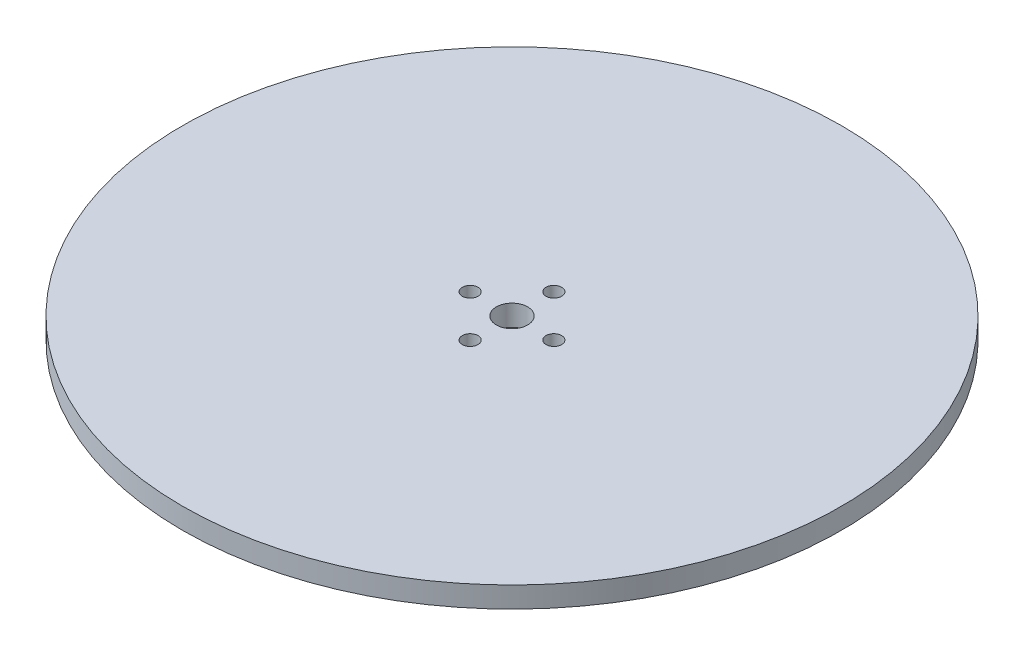
ISO-10303-21;
HEADER;
FILE_DESCRIPTION(('STEP AP214'),'2;1');
FILE_NAME('part.step','',(''),(''),'','','');
FILE_SCHEMA(('AUTOMOTIVE_DESIGN { 1 0 10303 214 1 1 1 1 }'));
ENDSEC;
DATA;
#1=APPLICATION_CONTEXT('core data for automotive mechanical design processes');
#2=APPLICATION_PROTOCOL_DEFINITION('international standard','automotive_design',2000,#1);
#3=PRODUCT_CONTEXT('',#1,'mechanical');
#4=PRODUCT('Part','Part','',(#3));
#5=PRODUCT_RELATED_PRODUCT_CATEGORY('part','',(#4));
#6=PRODUCT_DEFINITION_FORMATION('','',#4);
#7=PRODUCT_DEFINITION_CONTEXT('part definition',#1,'design');
#8=PRODUCT_DEFINITION('design','',#6,#7);
#9=PRODUCT_DEFINITION_SHAPE('','',#8);
#10=(LENGTH_UNIT() NAMED_UNIT(*) SI_UNIT(.MILLI.,.METRE.));
#11=(NAMED_UNIT(*) PLANE_ANGLE_UNIT() SI_UNIT($,.RADIAN.));
#12=(NAMED_UNIT(*) SI_UNIT($,.STERADIAN.) SOLID_ANGLE_UNIT());
#13=UNCERTAINTY_MEASURE_WITH_UNIT(LENGTH_MEASURE(1.E-05),#10,'distance_accuracy_value','');
#14=(GEOMETRIC_REPRESENTATION_CONTEXT(3) GLOBAL_UNCERTAINTY_ASSIGNED_CONTEXT((#13)) GLOBAL_UNIT_ASSIGNED_CONTEXT((#10,
#11,#12)) REPRESENTATION_CONTEXT('',''));
#15=CARTESIAN_POINT('',(0.,0.,0.));
#16=DIRECTION('',(0.,0.,1.));
#17=DIRECTION('',(1.,0.,0.));
#18=AXIS2_PLACEMENT_3D('',#15,#16,#17);
#19=CARTESIAN_POINT('',(0.,4.,0.));
#20=DIRECTION('',(0.,-1.,0.));
#21=DIRECTION('',(0.,0.,-1.));
#22=AXIS2_PLACEMENT_3D('',#19,#20,#21);
#23=CYLINDRICAL_SURFACE('',#22,63.);
#24=CARTESIAN_POINT('',(0.,4.,0.));
#25=DIRECTION('',(0.,1.,0.));
#26=DIRECTION('',(0.,0.,1.));
#27=AXIS2_PLACEMENT_3D('',#24,#25,#26);
#28=CIRCLE('',#27,63.);
#29=CARTESIAN_POINT('',(0.,4.,63.));
#30=VERTEX_POINT('',#29);
#31=EDGE_CURVE('E10',#30,#30,#28,.T.);
#32=ORIENTED_EDGE('',*,*,#31,.F.);
#33=EDGE_LOOP('',(#32));
#34=FACE_BOUND('',#33,.T.);
#35=CARTESIAN_POINT('',(0.,0.,0.));
#36=DIRECTION('',(0.,1.,0.));
#37=DIRECTION('',(0.,0.,1.));
#38=AXIS2_PLACEMENT_3D('',#35,#36,#37);
#39=CIRCLE('',#38,63.);
#40=CARTESIAN_POINT('',(0.,0.,63.));
#41=VERTEX_POINT('',#40);
#42=EDGE_CURVE('E42',#41,#41,#39,.T.);
#43=ORIENTED_EDGE('',*,*,#42,.T.);
#44=EDGE_LOOP('',(#43));
#45=FACE_BOUND('',#44,.T.);
#46=ADVANCED_FACE('F39',(#34,#45),#23,.T.);
#47=CARTESIAN_POINT('',(0.,4.,0.));
#48=DIRECTION('',(0.,1.,0.));
#49=DIRECTION('',(0.,0.,1.));
#50=AXIS2_PLACEMENT_3D('',#47,#48,#49);
#51=PLANE('',#50);
#52=CARTESIAN_POINT('',(8.,4.,0.));
#53=DIRECTION('',(0.,1.,0.));
#54=DIRECTION('',(0.,0.,1.));
#55=AXIS2_PLACEMENT_3D('',#52,#53,#54);
#56=CIRCLE('',#55,1.5);
#57=CARTESIAN_POINT('',(8.,4.,1.5));
#58=VERTEX_POINT('',#57);
#59=EDGE_CURVE('E70',#58,#58,#56,.T.);
#60=ORIENTED_EDGE('',*,*,#59,.F.);
#61=EDGE_LOOP('',(#60));
#62=FACE_BOUND('',#61,.T.);
#63=CARTESIAN_POINT('',(0.,4.,0.));
#64=DIRECTION('',(0.,1.,0.));
#65=DIRECTION('',(0.,0.,1.));
#66=AXIS2_PLACEMENT_3D('',#63,#64,#65);
#67=CIRCLE('',#66,3.);
#68=CARTESIAN_POINT('',(0.,4.,3.));
#69=VERTEX_POINT('',#68);
#70=EDGE_CURVE('E71',#69,#69,#67,.T.);
#71=ORIENTED_EDGE('',*,*,#70,.F.);
#72=EDGE_LOOP('',(#71));
#73=FACE_BOUND('',#72,.T.);
#74=CARTESIAN_POINT('',(0.,4.,8.));
#75=DIRECTION('',(0.,1.,0.));
#76=DIRECTION('',(0.,0.,1.));
#77=AXIS2_PLACEMENT_3D('',#74,#75,#76);
#78=CIRCLE('',#77,1.5);
#79=CARTESIAN_POINT('',(0.,4.,9.5));
#80=VERTEX_POINT('',#79);
#81=EDGE_CURVE('E79',#80,#80,#78,.T.);
#82=ORIENTED_EDGE('',*,*,#81,.F.);
#83=EDGE_LOOP('',(#82));
#84=FACE_BOUND('',#83,.T.);
#85=CARTESIAN_POINT('',(-8.,4.,0.));
#86=DIRECTION('',(0.,1.,0.));
#87=DIRECTION('',(0.,0.,1.));
#88=AXIS2_PLACEMENT_3D('',#85,#86,#87);
#89=CIRCLE('',#88,1.5);
#90=CARTESIAN_POINT('',(-8.,4.,1.5));
#91=VERTEX_POINT('',#90);
#92=EDGE_CURVE('E53',#91,#91,#89,.T.);
#93=ORIENTED_EDGE('',*,*,#92,.F.);
#94=EDGE_LOOP('',(#93));
#95=FACE_BOUND('',#94,.T.);
#96=CARTESIAN_POINT('',(0.,4.,-8.));
#97=DIRECTION('',(0.,1.,0.));
#98=DIRECTION('',(0.,0.,1.));
#99=AXIS2_PLACEMENT_3D('',#96,#97,#98);
#100=CIRCLE('',#99,1.5);
#101=CARTESIAN_POINT('',(0.,4.,-6.5));
#102=VERTEX_POINT('',#101);
#103=EDGE_CURVE('E62',#102,#102,#100,.T.);
#104=ORIENTED_EDGE('',*,*,#103,.F.);
#105=EDGE_LOOP('',(#104));
#106=FACE_BOUND('',#105,.T.);
#107=ORIENTED_EDGE('',*,*,#31,.T.);
#108=EDGE_LOOP('',(#107));
#109=FACE_BOUND('',#108,.T.);
#110=ADVANCED_FACE('F103',(#62,#73,#84,#95,#106,#109),#51,.T.);
#111=CARTESIAN_POINT('',(0.,0.,0.));
#112=DIRECTION('',(0.,1.,0.));
#113=DIRECTION('',(0.,0.,1.));
#114=AXIS2_PLACEMENT_3D('',#111,#112,#113);
#115=PLANE('',#114);
#116=CARTESIAN_POINT('',(8.,0.,0.));
#117=DIRECTION('',(0.,1.,0.));
#118=DIRECTION('',(0.,0.,1.));
#119=AXIS2_PLACEMENT_3D('',#116,#117,#118);
#120=CIRCLE('',#119,1.5);
#121=CARTESIAN_POINT('',(8.,0.,1.5));
#122=VERTEX_POINT('',#121);
#123=EDGE_CURVE('E51',#122,#122,#120,.T.);
#124=ORIENTED_EDGE('',*,*,#123,.T.);
#125=EDGE_LOOP('',(#124));
#126=FACE_BOUND('',#125,.T.);
#127=CARTESIAN_POINT('',(0.,0.,0.));
#128=DIRECTION('',(0.,1.,0.));
#129=DIRECTION('',(0.,0.,1.));
#130=AXIS2_PLACEMENT_3D('',#127,#128,#129);
#131=CIRCLE('',#130,3.);
#132=CARTESIAN_POINT('',(0.,0.,3.));
#133=VERTEX_POINT('',#132);
#134=EDGE_CURVE('E75',#133,#133,#131,.T.);
#135=ORIENTED_EDGE('',*,*,#134,.T.);
#136=EDGE_LOOP('',(#135));
#137=FACE_BOUND('',#136,.T.);
#138=CARTESIAN_POINT('',(0.,0.,8.));
#139=DIRECTION('',(0.,1.,0.));
#140=DIRECTION('',(0.,0.,1.));
#141=AXIS2_PLACEMENT_3D('',#138,#139,#140);
#142=CIRCLE('',#141,1.5);
#143=CARTESIAN_POINT('',(0.,0.,9.5));
#144=VERTEX_POINT('',#143);
#145=EDGE_CURVE('E58',#144,#144,#142,.T.);
#146=ORIENTED_EDGE('',*,*,#145,.T.);
#147=EDGE_LOOP('',(#146));
#148=FACE_BOUND('',#147,.T.);
#149=CARTESIAN_POINT('',(-8.,0.,0.));
#150=DIRECTION('',(0.,1.,0.));
#151=DIRECTION('',(0.,0.,1.));
#152=AXIS2_PLACEMENT_3D('',#149,#150,#151);
#153=CIRCLE('',#152,1.5);
#154=CARTESIAN_POINT('',(-8.,0.,1.5));
#155=VERTEX_POINT('',#154);
#156=EDGE_CURVE('E57',#155,#155,#153,.T.);
#157=ORIENTED_EDGE('',*,*,#156,.T.);
#158=EDGE_LOOP('',(#157));
#159=FACE_BOUND('',#158,.T.);
#160=CARTESIAN_POINT('',(0.,0.,-8.));
#161=DIRECTION('',(0.,1.,0.));
#162=DIRECTION('',(0.,0.,1.));
#163=AXIS2_PLACEMENT_3D('',#160,#161,#162);
#164=CIRCLE('',#163,1.5);
#165=CARTESIAN_POINT('',(0.,0.,-6.5));
#166=VERTEX_POINT('',#165);
#167=EDGE_CURVE('E66',#166,#166,#164,.T.);
#168=ORIENTED_EDGE('',*,*,#167,.T.);
#169=EDGE_LOOP('',(#168));
#170=FACE_BOUND('',#169,.T.);
#171=ORIENTED_EDGE('',*,*,#42,.F.);
#172=EDGE_LOOP('',(#171));
#173=FACE_BOUND('',#172,.T.);
#174=ADVANCED_FACE('F93',(#126,#137,#148,#159,#170,#173),#115,.F.);
#175=CARTESIAN_POINT('',(0.,0.,-8.));
#176=DIRECTION('',(0.,1.,0.));
#177=DIRECTION('',(0.,0.,1.));
#178=AXIS2_PLACEMENT_3D('',#175,#176,#177);
#179=CYLINDRICAL_SURFACE('',#178,1.5);
#180=ORIENTED_EDGE('',*,*,#167,.F.);
#181=EDGE_LOOP('',(#180));
#182=FACE_BOUND('',#181,.T.);
#183=ORIENTED_EDGE('',*,*,#103,.T.);
#184=EDGE_LOOP('',(#183));
#185=FACE_BOUND('',#184,.T.);
#186=ADVANCED_FACE('F115',(#182,#185),#179,.F.);
#187=CARTESIAN_POINT('',(-8.,0.,0.));
#188=DIRECTION('',(0.,1.,0.));
#189=DIRECTION('',(0.,0.,1.));
#190=AXIS2_PLACEMENT_3D('',#187,#188,#189);
#191=CYLINDRICAL_SURFACE('',#190,1.5);
#192=ORIENTED_EDGE('',*,*,#156,.F.);
#193=EDGE_LOOP('',(#192));
#194=FACE_BOUND('',#193,.T.);
#195=ORIENTED_EDGE('',*,*,#92,.T.);
#196=EDGE_LOOP('',(#195));
#197=FACE_BOUND('',#196,.T.);
#198=ADVANCED_FACE('F117',(#194,#197),#191,.F.);
#199=CARTESIAN_POINT('',(0.,0.,8.));
#200=DIRECTION('',(0.,1.,0.));
#201=DIRECTION('',(0.,0.,1.));
#202=AXIS2_PLACEMENT_3D('',#199,#200,#201);
#203=CYLINDRICAL_SURFACE('',#202,1.5);
#204=ORIENTED_EDGE('',*,*,#145,.F.);
#205=EDGE_LOOP('',(#204));
#206=FACE_BOUND('',#205,.T.);
#207=ORIENTED_EDGE('',*,*,#81,.T.);
#208=EDGE_LOOP('',(#207));
#209=FACE_BOUND('',#208,.T.);
#210=ADVANCED_FACE('F124',(#206,#209),#203,.F.);
#211=CARTESIAN_POINT('',(0.,0.,0.));
#212=DIRECTION('',(0.,1.,0.));
#213=DIRECTION('',(0.,0.,1.));
#214=AXIS2_PLACEMENT_3D('',#211,#212,#213);
#215=CYLINDRICAL_SURFACE('',#214,3.);
#216=ORIENTED_EDGE('',*,*,#134,.F.);
#217=EDGE_LOOP('',(#216));
#218=FACE_BOUND('',#217,.T.);
#219=ORIENTED_EDGE('',*,*,#70,.T.);
#220=EDGE_LOOP('',(#219));
#221=FACE_BOUND('',#220,.T.);
#222=ADVANCED_FACE('F99',(#218,#221),#215,.F.);
#223=CARTESIAN_POINT('',(8.,0.,0.));
#224=DIRECTION('',(0.,1.,0.));
#225=DIRECTION('',(0.,0.,1.));
#226=AXIS2_PLACEMENT_3D('',#223,#224,#225);
#227=CYLINDRICAL_SURFACE('',#226,1.5);
#228=ORIENTED_EDGE('',*,*,#123,.F.);
#229=EDGE_LOOP('',(#228));
#230=FACE_BOUND('',#229,.T.);
#231=ORIENTED_EDGE('',*,*,#59,.T.);
#232=EDGE_LOOP('',(#231));
#233=FACE_BOUND('',#232,.T.);
#234=ADVANCED_FACE('F96',(#230,#233),#227,.F.);
#235=CLOSED_SHELL('',(#46,#110,#174,#186,#198,#210,#222,#234));
#236=MANIFOLD_SOLID_BREP('B2',#235);
#237=ADVANCED_BREP_SHAPE_REPRESENTATION('',(#18,#236),#14);
#238=SHAPE_DEFINITION_REPRESENTATION(#9,#237);
ENDSEC;
END-ISO-10303-21;
